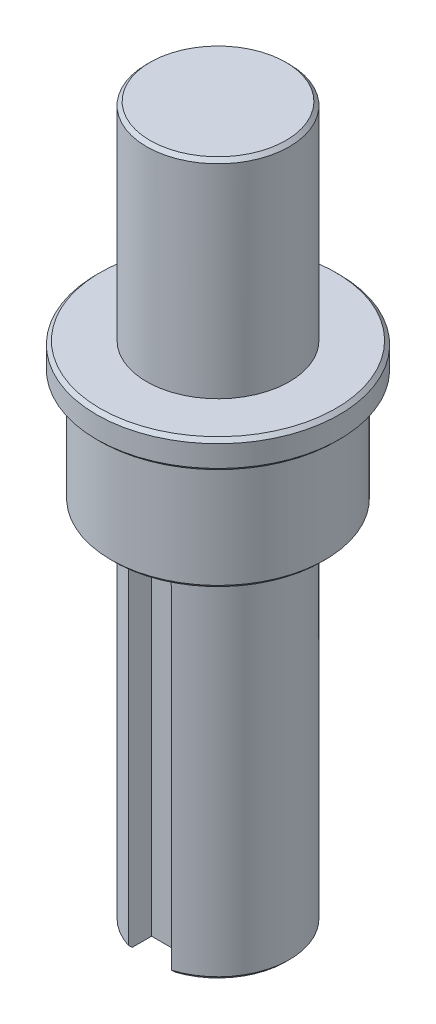
ISO-10303-21;
HEADER;
FILE_DESCRIPTION(('STEP AP214'),'2;1');
FILE_NAME('part.step','',(''),(''),'','','');
FILE_SCHEMA(('AUTOMOTIVE_DESIGN { 1 0 10303 214 1 1 1 1 }'));
ENDSEC;
DATA;
#1=APPLICATION_CONTEXT('core data for automotive mechanical design processes');
#2=APPLICATION_PROTOCOL_DEFINITION('international standard','automotive_design',2000,#1);
#3=PRODUCT_CONTEXT('',#1,'mechanical');
#4=PRODUCT('Part','Part','',(#3));
#5=PRODUCT_RELATED_PRODUCT_CATEGORY('part','',(#4));
#6=PRODUCT_DEFINITION_FORMATION('','',#4);
#7=PRODUCT_DEFINITION_CONTEXT('part definition',#1,'design');
#8=PRODUCT_DEFINITION('design','',#6,#7);
#9=PRODUCT_DEFINITION_SHAPE('','',#8);
#10=(LENGTH_UNIT() NAMED_UNIT(*) SI_UNIT(.MILLI.,.METRE.));
#11=(NAMED_UNIT(*) PLANE_ANGLE_UNIT() SI_UNIT($,.RADIAN.));
#12=(NAMED_UNIT(*) SI_UNIT($,.STERADIAN.) SOLID_ANGLE_UNIT());
#13=UNCERTAINTY_MEASURE_WITH_UNIT(LENGTH_MEASURE(1.E-05),#10,'distance_accuracy_value','');
#14=(GEOMETRIC_REPRESENTATION_CONTEXT(3) GLOBAL_UNCERTAINTY_ASSIGNED_CONTEXT((#13)) GLOBAL_UNIT_ASSIGNED_CONTEXT((#10,
#11,#12)) REPRESENTATION_CONTEXT('',''));
#15=CARTESIAN_POINT('',(0.,0.,0.));
#16=DIRECTION('',(0.,0.,1.));
#17=DIRECTION('',(1.,0.,0.));
#18=AXIS2_PLACEMENT_3D('',#15,#16,#17);
#19=CARTESIAN_POINT('',(0.,55.3655780461796,0.));
#20=DIRECTION('',(0.,1.,0.));
#21=DIRECTION('',(0.,0.,1.));
#22=AXIS2_PLACEMENT_3D('',#19,#20,#21);
#23=PLANE('',#22);
#24=CARTESIAN_POINT('',(0.,55.3655780461796,0.));
#25=DIRECTION('',(0.,1.,0.));
#26=DIRECTION('',(0.,0.,1.));
#27=AXIS2_PLACEMENT_3D('',#24,#25,#26);
#28=CIRCLE('',#27,4.75000000000002);
#29=CARTESIAN_POINT('',(0.,55.3655780461796,4.75000000000002));
#30=VERTEX_POINT('',#29);
#31=EDGE_CURVE('E165',#30,#30,#28,.T.);
#32=ORIENTED_EDGE('',*,*,#31,.T.);
#33=EDGE_LOOP('',(#32));
#34=FACE_BOUND('',#33,.T.);
#35=ADVANCED_FACE('F33',(#34),#23,.T.);
#36=CARTESIAN_POINT('',(0.,0.,0.));
#37=DIRECTION('',(0.,-1.,0.));
#38=DIRECTION('',(0.,0.,-1.));
#39=AXIS2_PLACEMENT_3D('',#36,#37,#38);
#40=CYLINDRICAL_SURFACE('',#39,5.);
#41=CARTESIAN_POINT('',(0.,55.1155780461796,0.));
#42=DIRECTION('',(0.,1.,0.));
#43=DIRECTION('',(0.,0.,1.));
#44=AXIS2_PLACEMENT_3D('',#41,#42,#43);
#45=CIRCLE('',#44,5.);
#46=CARTESIAN_POINT('',(0.,55.1155780461796,5.));
#47=VERTEX_POINT('',#46);
#48=EDGE_CURVE('E162',#47,#47,#45,.F.);
#49=ORIENTED_EDGE('',*,*,#48,.T.);
#50=EDGE_LOOP('',(#49));
#51=FACE_BOUND('',#50,.T.);
#52=CARTESIAN_POINT('',(0.,40.8655780461796,0.));
#53=DIRECTION('',(0.,-1.,0.));
#54=DIRECTION('',(0.,0.,-1.));
#55=AXIS2_PLACEMENT_3D('',#52,#53,#54);
#56=CIRCLE('',#55,5.);
#57=CARTESIAN_POINT('',(0.,40.8655780461796,-5.));
#58=VERTEX_POINT('',#57);
#59=EDGE_CURVE('E130',#58,#58,#56,.T.);
#60=ORIENTED_EDGE('',*,*,#59,.F.);
#61=EDGE_LOOP('',(#60));
#62=FACE_BOUND('',#61,.T.);
#63=ADVANCED_FACE('F239',(#51,#62),#40,.T.);
#64=CARTESIAN_POINT('',(5.,40.8655780461796,0.));
#65=DIRECTION('',(0.,1.,0.));
#66=DIRECTION('',(0.,0.,1.));
#67=AXIS2_PLACEMENT_3D('',#64,#65,#66);
#68=PLANE('',#67);
#69=CARTESIAN_POINT('',(0.,40.8655780461796,0.));
#70=DIRECTION('',(0.,1.,0.));
#71=DIRECTION('',(0.,0.,1.));
#72=AXIS2_PLACEMENT_3D('',#69,#70,#71);
#73=CIRCLE('',#72,8.24999999999998);
#74=CARTESIAN_POINT('',(0.,40.8655780461796,8.24999999999998));
#75=VERTEX_POINT('',#74);
#76=EDGE_CURVE('E148',#75,#75,#73,.T.);
#77=ORIENTED_EDGE('',*,*,#76,.T.);
#78=EDGE_LOOP('',(#77));
#79=FACE_BOUND('',#78,.T.);
#80=ORIENTED_EDGE('',*,*,#59,.T.);
#81=EDGE_LOOP('',(#80));
#82=FACE_BOUND('',#81,.T.);
#83=ADVANCED_FACE('F245',(#79,#82),#68,.T.);
#84=CARTESIAN_POINT('',(0.,0.,0.));
#85=DIRECTION('',(0.,-1.,0.));
#86=DIRECTION('',(0.,0.,-1.));
#87=AXIS2_PLACEMENT_3D('',#84,#85,#86);
#88=CYLINDRICAL_SURFACE('',#87,8.5);
#89=CARTESIAN_POINT('',(0.,39.1155780461796,0.));
#90=DIRECTION('',(0.,-1.,0.));
#91=DIRECTION('',(0.,0.,-1.));
#92=AXIS2_PLACEMENT_3D('',#89,#90,#91);
#93=CIRCLE('',#92,8.5);
#94=CARTESIAN_POINT('',(0.,39.1155780461796,-8.5));
#95=VERTEX_POINT('',#94);
#96=EDGE_CURVE('E145',#95,#95,#93,.F.);
#97=ORIENTED_EDGE('',*,*,#96,.T.);
#98=EDGE_LOOP('',(#97));
#99=FACE_BOUND('',#98,.T.);
#100=CARTESIAN_POINT('',(0.,40.6155780461796,0.));
#101=DIRECTION('',(0.,1.,0.));
#102=DIRECTION('',(0.,0.,1.));
#103=AXIS2_PLACEMENT_3D('',#100,#101,#102);
#104=CIRCLE('',#103,8.5);
#105=CARTESIAN_POINT('',(0.,40.6155780461796,8.5));
#106=VERTEX_POINT('',#105);
#107=EDGE_CURVE('E142',#106,#106,#104,.F.);
#108=ORIENTED_EDGE('',*,*,#107,.T.);
#109=EDGE_LOOP('',(#108));
#110=FACE_BOUND('',#109,.T.);
#111=ADVANCED_FACE('F349',(#99,#110),#88,.T.);
#112=CARTESIAN_POINT('',(8.5,38.8655780461796,0.));
#113=DIRECTION('',(0.,-1.,0.));
#114=DIRECTION('',(0.,0.,-1.));
#115=AXIS2_PLACEMENT_3D('',#112,#113,#114);
#116=PLANE('',#115);
#117=CARTESIAN_POINT('',(0.,38.8655780461796,0.));
#118=DIRECTION('',(0.,-1.,0.));
#119=DIRECTION('',(0.,0.,-1.));
#120=AXIS2_PLACEMENT_3D('',#117,#118,#119);
#121=CIRCLE('',#120,8.25);
#122=CARTESIAN_POINT('',(0.,38.8655780461796,-8.25));
#123=VERTEX_POINT('',#122);
#124=EDGE_CURVE('E139',#123,#123,#121,.T.);
#125=ORIENTED_EDGE('',*,*,#124,.T.);
#126=EDGE_LOOP('',(#125));
#127=FACE_BOUND('',#126,.T.);
#128=CARTESIAN_POINT('',(0.,38.8655780461796,0.));
#129=DIRECTION('',(0.,-1.,0.));
#130=DIRECTION('',(0.,0.,-1.));
#131=AXIS2_PLACEMENT_3D('',#128,#129,#130);
#132=CIRCLE('',#131,7.5);
#133=CARTESIAN_POINT('',(0.,38.8655780461796,-7.5));
#134=VERTEX_POINT('',#133);
#135=EDGE_CURVE('E127',#134,#134,#132,.T.);
#136=ORIENTED_EDGE('',*,*,#135,.F.);
#137=EDGE_LOOP('',(#136));
#138=FACE_BOUND('',#137,.T.);
#139=ADVANCED_FACE('F342',(#127,#138),#116,.T.);
#140=CARTESIAN_POINT('',(0.,0.,0.));
#141=DIRECTION('',(0.,-1.,0.));
#142=DIRECTION('',(0.,0.,-1.));
#143=AXIS2_PLACEMENT_3D('',#140,#141,#142);
#144=CYLINDRICAL_SURFACE('',#143,7.5);
#145=CARTESIAN_POINT('',(0.,31.3155780461796,0.));
#146=DIRECTION('',(0.,-1.,0.));
#147=DIRECTION('',(0.,0.,-1.));
#148=AXIS2_PLACEMENT_3D('',#145,#146,#147);
#149=CIRCLE('',#148,7.5);
#150=CARTESIAN_POINT('',(0.,31.3155780461796,-7.5));
#151=VERTEX_POINT('',#150);
#152=EDGE_CURVE('E136',#151,#151,#149,.F.);
#153=ORIENTED_EDGE('',*,*,#152,.T.);
#154=EDGE_LOOP('',(#153));
#155=FACE_BOUND('',#154,.T.);
#156=ORIENTED_EDGE('',*,*,#135,.T.);
#157=EDGE_LOOP('',(#156));
#158=FACE_BOUND('',#157,.T.);
#159=ADVANCED_FACE('F337',(#155,#158),#144,.T.);
#160=CARTESIAN_POINT('',(7.5,31.0655780461796,0.));
#161=DIRECTION('',(0.,-1.,0.));
#162=DIRECTION('',(0.,0.,-1.));
#163=AXIS2_PLACEMENT_3D('',#160,#161,#162);
#164=PLANE('',#163);
#165=CARTESIAN_POINT('',(0.,31.0655780461796,0.));
#166=DIRECTION('',(0.,-1.,0.));
#167=DIRECTION('',(0.,0.,-1.));
#168=AXIS2_PLACEMENT_3D('',#165,#166,#167);
#169=CIRCLE('',#168,7.25000000000002);
#170=CARTESIAN_POINT('',(0.,31.0655780461796,-7.25000000000002));
#171=VERTEX_POINT('',#170);
#172=EDGE_CURVE('E133',#171,#171,#169,.T.);
#173=ORIENTED_EDGE('',*,*,#172,.T.);
#174=EDGE_LOOP('',(#173));
#175=FACE_BOUND('',#174,.T.);
#176=CARTESIAN_POINT('',(0.,31.0655780461796,0.));
#177=DIRECTION('',(0.,-1.,0.));
#178=DIRECTION('',(0.,0.,-1.));
#179=AXIS2_PLACEMENT_3D('',#176,#177,#178);
#180=CIRCLE('',#179,5.);
#181=CARTESIAN_POINT('',(0.,31.0655780461796,-5.));
#182=VERTEX_POINT('',#181);
#183=EDGE_CURVE('E124',#182,#182,#180,.T.);
#184=ORIENTED_EDGE('',*,*,#183,.F.);
#185=EDGE_LOOP('',(#184));
#186=FACE_BOUND('',#185,.T.);
#187=ADVANCED_FACE('F211',(#175,#186),#164,.T.);
#188=CARTESIAN_POINT('',(0.,0.,0.));
#189=DIRECTION('',(0.,-1.,0.));
#190=DIRECTION('',(0.,0.,-1.));
#191=AXIS2_PLACEMENT_3D('',#188,#189,#190);
#192=CYLINDRICAL_SURFACE('',#191,5.);
#193=DIRECTION('',(0.,-1.,0.));
#194=VECTOR('',#193,1.);
#195=CARTESIAN_POINT('',(-1.5,0.,4.76969600708473));
#196=LINE('',#195,#194);
#197=CARTESIAN_POINT('',(-1.5,29.0655780461796,4.76969600708473));
#198=VERTEX_POINT('',#197);
#199=CARTESIAN_POINT('',(-1.5,5.81557804617957,4.76969600708473));
#200=VERTEX_POINT('',#199);
#201=EDGE_CURVE('E119',#198,#200,#196,.T.);
#202=ORIENTED_EDGE('',*,*,#201,.F.);
#203=CARTESIAN_POINT('',(-1.5,29.0655780461796,4.76969600708473));
#204=CARTESIAN_POINT('',(-1.50000085359987,29.1067588568557,4.76969248993095));
#205=CARTESIAN_POINT('',(-1.49830305374632,29.1479189250242,4.77023000663726));
#206=CARTESIAN_POINT('',(-1.49153727481279,29.2299248430673,4.77235113343356));
#207=CARTESIAN_POINT('',(-1.48647005385463,29.2707707615349,4.7739345082043));
#208=CARTESIAN_POINT('',(-1.46630065235378,29.3921740899327,4.78018533002168));
#209=CARTESIAN_POINT('',(-1.44623028637151,29.4718871065223,4.78635397305579));
#210=CARTESIAN_POINT('',(-1.39353147335906,29.6266123274067,4.80195939037488));
#211=CARTESIAN_POINT('',(-1.36090719903445,29.7016260840324,4.81139507864529));
#212=CARTESIAN_POINT('',(-1.28407985018232,29.8451724452828,4.8324653260204));
#213=CARTESIAN_POINT('',(-1.23987100279312,29.9137017953376,4.8441009806121));
#214=CARTESIAN_POINT('',(-1.13964930893702,30.0444432152147,4.86866818200433));
#215=CARTESIAN_POINT('',(-1.08333633607985,30.1064199966792,4.88162718483485));
#216=CARTESIAN_POINT('',(-0.961140113903204,30.2202123641536,4.90714781796852));
#217=CARTESIAN_POINT('',(-0.89525500200505,30.2720259679565,4.9197093703538));
#218=CARTESIAN_POINT('',(-0.754090160225416,30.3650558233472,4.94333592434221));
#219=CARTESIAN_POINT('',(-0.678642338077991,30.4060269492916,4.95436400128813));
#220=CARTESIAN_POINT('',(-0.521563369050344,30.4745847769378,4.97335005202751));
#221=CARTESIAN_POINT('',(-0.439937649841662,30.5021830732554,4.98131068415016));
#222=CARTESIAN_POINT('',(-0.298264456021696,30.5368470073067,4.99143710038863));
#223=CARTESIAN_POINT('',(-0.239166490668787,30.5475994120532,4.99462764738927));
#224=CARTESIAN_POINT('',(-0.12005739141902,30.5619720635374,4.998918178526));
#225=CARTESIAN_POINT('',(-0.0600465820525057,30.565594787908,5.00001888889585));
#226=CARTESIAN_POINT('',(0.,30.5655780461796,5.));
#227=B_SPLINE_CURVE_WITH_KNOTS('',3,(#203,#204,#205,#206,#207,#208,#209,#210,#211,#212,#213,
#214,#215,#216,#217,#218,#219,#220,#221,#222,#223,#224,#225,#226),.UNSPECIFIED.,.F.,.F.,(4,2,2,
2,2,2,2,2,2,2,2,4),(0.,0.123463321048064,0.24689887216849,0.492911372366583,0.738842172727399,
0.984895759946682,1.23795183323011,1.49105721311967,1.74947248420819,2.00766329935825,
2.1876802778492,2.36763468764484),.UNSPECIFIED.);
#228=CARTESIAN_POINT('',(0.,30.5655780461796,5.));
#229=VERTEX_POINT('',#228);
#230=EDGE_CURVE('E11',#198,#229,#227,.T.);
#231=ORIENTED_EDGE('',*,*,#230,.T.);
#232=CARTESIAN_POINT('',(0.,30.5655780461796,5.));
#233=CARTESIAN_POINT('',(0.0412230773899808,30.5655787870539,5.00000277613313));
#234=CARTESIAN_POINT('',(0.0824255570982469,30.5638776069156,4.99948958398081));
#235=CARTESIAN_POINT('',(0.164518730866948,30.5570976301866,4.99746087704899));
#236=CARTESIAN_POINT('',(0.205409485177794,30.5520195039418,4.9959455611979));
#237=CARTESIAN_POINT('',(0.326963301776202,30.5318028708759,4.98995381331756));
#238=CARTESIAN_POINT('',(0.406785158642714,30.5116816969559,4.98403118606551));
#239=CARTESIAN_POINT('',(0.561734538434264,30.4588351670383,4.96895678681409));
#240=CARTESIAN_POINT('',(0.636863069535107,30.4261125288633,4.95980571114645));
#241=CARTESIAN_POINT('',(0.780600785691843,30.3490549515031,4.93922435519071));
#242=CARTESIAN_POINT('',(0.849207204843492,30.3047151153591,4.92779311423827));
#243=CARTESIAN_POINT('',(0.97986969539363,30.2043564797735,4.90350796272656));
#244=CARTESIAN_POINT('',(1.0417124952522,30.1480671774607,4.8906250718143));
#245=CARTESIAN_POINT('',(1.15524422121796,30.025974419819,4.86505948668359));
#246=CARTESIAN_POINT('',(1.20693049442307,29.9601684865012,4.85237684556416));
#247=CARTESIAN_POINT('',(1.29981663905891,29.8190842149488,4.82833698781928));
#248=CARTESIAN_POINT('',(1.34075062074078,29.7436241491111,4.81701657361784));
#249=CARTESIAN_POINT('',(1.40923482373452,29.5865232188316,4.79742985037451));
#250=CARTESIAN_POINT('',(1.43679764279335,29.5048882562876,4.78916066835566));
#251=CARTESIAN_POINT('',(1.47137173672671,29.36331012738,4.77862845517374));
#252=CARTESIAN_POINT('',(1.48208442594249,29.3043243465226,4.77530350348452));
#253=CARTESIAN_POINT('',(1.49640626854262,29.1854306551123,4.7708262463819));
#254=CARTESIAN_POINT('',(1.5000169977961,29.1255229521007,4.76967345898471));
#255=CARTESIAN_POINT('',(1.5,29.0655780461796,4.76969600708473));
#256=B_SPLINE_CURVE_WITH_KNOTS('',3,(#232,#233,#234,#235,#236,#237,#238,#239,#240,#241,#242,
#243,#244,#245,#246,#247,#248,#249,#250,#251,#252,#253,#254,#255),.UNSPECIFIED.,.F.,.F.,(4,2,2,
2,2,2,2,2,2,2,2,4),(0.,0.123590522760266,0.247156519315276,0.493467728235494,0.73972584367575,
0.98608793095597,1.23877207809718,1.49152213929097,1.75003354782293,2.00830092246139,
2.18798745648376,2.36763411497588),.UNSPECIFIED.);
#257=CARTESIAN_POINT('',(1.5,29.0655780461796,4.76969600708473));
#258=VERTEX_POINT('',#257);
#259=EDGE_CURVE('E43',#229,#258,#256,.T.);
#260=ORIENTED_EDGE('',*,*,#259,.T.);
#261=DIRECTION('',(0.,-1.,0.));
#262=VECTOR('',#261,1.);
#263=CARTESIAN_POINT('',(1.5,0.,4.76969600708473));
#264=LINE('',#263,#262);
#265=CARTESIAN_POINT('',(1.5,5.81557804617957,4.76969600708473));
#266=VERTEX_POINT('',#265);
#267=EDGE_CURVE('E115',#266,#258,#264,.F.);
#268=ORIENTED_EDGE('',*,*,#267,.F.);
#269=CARTESIAN_POINT('',(0.,5.81557804617957,0.));
#270=DIRECTION('',(0.,-1.,0.));
#271=DIRECTION('',(0.,0.,-1.));
#272=AXIS2_PLACEMENT_3D('',#269,#270,#271);
#273=CIRCLE('',#272,5.);
#274=EDGE_CURVE('E159',#266,#200,#273,.F.);
#275=ORIENTED_EDGE('',*,*,#274,.T.);
#276=EDGE_LOOP('',(#202,#231,#260,#268,#275));
#277=FACE_BOUND('',#276,.T.);
#278=ORIENTED_EDGE('',*,*,#183,.T.);
#279=EDGE_LOOP('',(#278));
#280=FACE_BOUND('',#279,.T.);
#281=ADVANCED_FACE('F207',(#277,#280),#192,.T.);
#282=CARTESIAN_POINT('',(5.,5.56557804617958,0.));
#283=DIRECTION('',(0.,-1.,0.));
#284=DIRECTION('',(0.,0.,-1.));
#285=AXIS2_PLACEMENT_3D('',#282,#283,#284);
#286=PLANE('',#285);
#287=DIRECTION('',(0.,0.,-1.));
#288=VECTOR('',#287,1.);
#289=CARTESIAN_POINT('',(-1.5,5.56557804617958,6.15));
#290=LINE('',#289,#288);
#291=CARTESIAN_POINT('',(-1.5,5.56557804617958,4.50693909432999));
#292=VERTEX_POINT('',#291);
#293=CARTESIAN_POINT('',(-1.5,5.56557804617958,3.15));
#294=VERTEX_POINT('',#293);
#295=EDGE_CURVE('E102',#292,#294,#290,.T.);
#296=ORIENTED_EDGE('',*,*,#295,.F.);
#297=CARTESIAN_POINT('',(0.,5.56557804617958,0.));
#298=DIRECTION('',(0.,-1.,0.));
#299=DIRECTION('',(0.,0.,-1.));
#300=AXIS2_PLACEMENT_3D('',#297,#298,#299);
#301=CIRCLE('',#300,4.75);
#302=CARTESIAN_POINT('',(1.5,5.56557804617958,4.50693909432999));
#303=VERTEX_POINT('',#302);
#304=EDGE_CURVE('E154',#292,#303,#301,.T.);
#305=ORIENTED_EDGE('',*,*,#304,.T.);
#306=DIRECTION('',(0.,0.,1.));
#307=VECTOR('',#306,1.);
#308=CARTESIAN_POINT('',(1.5,5.56557804617958,6.15));
#309=LINE('',#308,#307);
#310=CARTESIAN_POINT('',(1.5,5.56557804617958,3.15));
#311=VERTEX_POINT('',#310);
#312=EDGE_CURVE('E99',#311,#303,#309,.T.);
#313=ORIENTED_EDGE('',*,*,#312,.F.);
#314=DIRECTION('',(1.,0.,0.));
#315=VECTOR('',#314,1.);
#316=CARTESIAN_POINT('',(-1.5,5.56557804617958,3.15));
#317=LINE('',#316,#315);
#318=EDGE_CURVE('E94',#294,#311,#317,.T.);
#319=ORIENTED_EDGE('',*,*,#318,.F.);
#320=EDGE_LOOP('',(#296,#305,#313,#319));
#321=FACE_BOUND('',#320,.T.);
#322=CARTESIAN_POINT('',(0.,5.56557804617958,0.));
#323=DIRECTION('',(0.,-1.,0.));
#324=DIRECTION('',(0.,0.,-1.));
#325=AXIS2_PLACEMENT_3D('',#322,#323,#324);
#326=CIRCLE('',#325,1.9);
#327=CARTESIAN_POINT('',(0.,5.56557804617958,-1.9));
#328=VERTEX_POINT('',#327);
#329=EDGE_CURVE('E156',#328,#328,#326,.F.);
#330=ORIENTED_EDGE('',*,*,#329,.T.);
#331=EDGE_LOOP('',(#330));
#332=FACE_BOUND('',#331,.T.);
#333=ADVANCED_FACE('F110',(#321,#332),#286,.T.);
#334=CARTESIAN_POINT('',(0.,15.5655780461796,0.));
#335=DIRECTION('',(0.,-1.,0.));
#336=DIRECTION('',(0.,0.,-1.));
#337=AXIS2_PLACEMENT_3D('',#334,#335,#336);
#338=CONICAL_SURFACE('',#337,1.65,1.02974425867665);
#339=CARTESIAN_POINT('',(0.,16.5569980675751,0.));
#340=VERTEX_POINT('',#339);
#341=VERTEX_LOOP('',#340);
#342=FACE_BOUND('',#341,.T.);
#343=CARTESIAN_POINT('',(0.,15.5655780461796,0.));
#344=DIRECTION('',(0.,-1.,0.));
#345=DIRECTION('',(0.,0.,-1.));
#346=AXIS2_PLACEMENT_3D('',#343,#344,#345);
#347=CIRCLE('',#346,1.65);
#348=CARTESIAN_POINT('',(0.,15.5655780461796,-1.65));
#349=VERTEX_POINT('',#348);
#350=EDGE_CURVE('E121',#349,#349,#347,.T.);
#351=ORIENTED_EDGE('',*,*,#350,.T.);
#352=EDGE_LOOP('',(#351));
#353=FACE_BOUND('',#352,.T.);
#354=ADVANCED_FACE('F200',(#342,#353),#338,.F.);
#355=CARTESIAN_POINT('',(0.,5.56557804617958,0.));
#356=DIRECTION('',(0.,-1.,0.));
#357=DIRECTION('',(0.,0.,-1.));
#358=AXIS2_PLACEMENT_3D('',#355,#356,#357);
#359=CYLINDRICAL_SURFACE('',#358,1.65);
#360=CARTESIAN_POINT('',(0.,5.81557804617958,0.));
#361=DIRECTION('',(0.,-1.,0.));
#362=DIRECTION('',(0.,0.,-1.));
#363=AXIS2_PLACEMENT_3D('',#360,#361,#362);
#364=CIRCLE('',#363,1.65);
#365=CARTESIAN_POINT('',(0.,5.81557804617958,-1.65));
#366=VERTEX_POINT('',#365);
#367=EDGE_CURVE('E151',#366,#366,#364,.T.);
#368=ORIENTED_EDGE('',*,*,#367,.T.);
#369=EDGE_LOOP('',(#368));
#370=FACE_BOUND('',#369,.T.);
#371=ORIENTED_EDGE('',*,*,#350,.F.);
#372=EDGE_LOOP('',(#371));
#373=FACE_BOUND('',#372,.T.);
#374=ADVANCED_FACE('F196',(#370,#373),#359,.F.);
#375=CARTESIAN_POINT('',(0.,31.0655780461796,0.));
#376=DIRECTION('',(0.,1.,0.));
#377=DIRECTION('',(0.,0.,1.));
#378=AXIS2_PLACEMENT_3D('',#375,#376,#377);
#379=CONICAL_SURFACE('',#378,7.25000000000002,0.785398163397443);
#380=ORIENTED_EDGE('',*,*,#152,.F.);
#381=EDGE_LOOP('',(#380));
#382=FACE_BOUND('',#381,.T.);
#383=ORIENTED_EDGE('',*,*,#172,.F.);
#384=EDGE_LOOP('',(#383));
#385=FACE_BOUND('',#384,.T.);
#386=ADVANCED_FACE('F199',(#382,#385),#379,.T.);
#387=CARTESIAN_POINT('',(0.,38.8655780461796,0.));
#388=DIRECTION('',(0.,1.,0.));
#389=DIRECTION('',(0.,0.,1.));
#390=AXIS2_PLACEMENT_3D('',#387,#388,#389);
#391=CONICAL_SURFACE('',#390,8.25,0.785398163397448);
#392=ORIENTED_EDGE('',*,*,#96,.F.);
#393=EDGE_LOOP('',(#392));
#394=FACE_BOUND('',#393,.T.);
#395=ORIENTED_EDGE('',*,*,#124,.F.);
#396=EDGE_LOOP('',(#395));
#397=FACE_BOUND('',#396,.T.);
#398=ADVANCED_FACE('F252',(#394,#397),#391,.T.);
#399=CARTESIAN_POINT('',(0.,40.6155780461796,0.));
#400=DIRECTION('',(0.,-1.,0.));
#401=DIRECTION('',(0.,0.,-1.));
#402=AXIS2_PLACEMENT_3D('',#399,#400,#401);
#403=CONICAL_SURFACE('',#402,8.5,0.785398163397455);
#404=ORIENTED_EDGE('',*,*,#76,.F.);
#405=EDGE_LOOP('',(#404));
#406=FACE_BOUND('',#405,.T.);
#407=ORIENTED_EDGE('',*,*,#107,.F.);
#408=EDGE_LOOP('',(#407));
#409=FACE_BOUND('',#408,.T.);
#410=ADVANCED_FACE('F256',(#406,#409),#403,.T.);
#411=CARTESIAN_POINT('',(0.,5.81557804617958,0.));
#412=DIRECTION('',(0.,-1.,0.));
#413=DIRECTION('',(0.,0.,-1.));
#414=AXIS2_PLACEMENT_3D('',#411,#412,#413);
#415=CONICAL_SURFACE('',#414,1.65,0.785398163397437);
#416=ORIENTED_EDGE('',*,*,#329,.F.);
#417=EDGE_LOOP('',(#416));
#418=FACE_BOUND('',#417,.T.);
#419=ORIENTED_EDGE('',*,*,#367,.F.);
#420=EDGE_LOOP('',(#419));
#421=FACE_BOUND('',#420,.T.);
#422=ADVANCED_FACE('F234',(#418,#421),#415,.F.);
#423=CARTESIAN_POINT('',(0.,5.56557804617958,0.));
#424=DIRECTION('',(0.,1.,0.));
#425=DIRECTION('',(0.,0.,1.));
#426=AXIS2_PLACEMENT_3D('',#423,#424,#425);
#427=CONICAL_SURFACE('',#426,4.75,0.785398163397455);
#428=CARTESIAN_POINT('',(-1.5,7.89533460774791,6.91902832564446));
#429=CARTESIAN_POINT('',(-1.5,7.69647598334168,6.71553036797981));
#430=CARTESIAN_POINT('',(-1.5,7.49779954301674,6.51185357771266));
#431=CARTESIAN_POINT('',(-1.5,7.10098930384228,6.10398960654604));
#432=CARTESIAN_POINT('',(-1.5,6.90285548158691,5.89980244841184));
#433=CARTESIAN_POINT('',(-1.5,6.5073678458266,5.49082637246406));
#434=CARTESIAN_POINT('',(-1.5,6.31001376007984,5.28603771817635));
#435=CARTESIAN_POINT('',(-1.5,5.91628042457067,4.87550503869363));
#436=CARTESIAN_POINT('',(-1.5,5.7199012243852,4.66976096592086));
#437=CARTESIAN_POINT('',(-1.5,5.32845111293506,4.25680529238506));
#438=CARTESIAN_POINT('',(-1.5,5.13338101159559,4.04959292165795));
#439=CARTESIAN_POINT('',(-1.5,4.8424390790512,3.73724813314499));
#440=CARTESIAN_POINT('',(-1.5,4.74574148899583,3.6328852475839));
#441=CARTESIAN_POINT('',(-1.5,4.55305150555913,3.42350587425253));
#442=CARTESIAN_POINT('',(-1.5,4.4570591264121,3.31848937336798));
#443=CARTESIAN_POINT('',(-1.5,4.26594122041828,3.10757123419417));
#444=CARTESIAN_POINT('',(-1.5,4.17081616218705,3.00166917054749));
#445=CARTESIAN_POINT('',(-1.5,3.98179320751965,2.78878442607102));
#446=CARTESIAN_POINT('',(-1.5,3.88789524217197,2.68180180652687));
#447=CARTESIAN_POINT('',(-1.5,3.7017325294011,2.46634201067023));
#448=CARTESIAN_POINT('',(-1.5,3.60946845916267,2.35786424633837));
#449=CARTESIAN_POINT('',(-1.5,3.47285965508976,2.19364182998888));
#450=CARTESIAN_POINT('',(-1.5,3.42761703293877,2.13864473575473));
#451=CARTESIAN_POINT('',(-1.5,3.33786793225311,2.02804855440028));
#452=CARTESIAN_POINT('',(-1.5,3.29336149481503,1.97244943395737));
#453=CARTESIAN_POINT('',(-1.5,3.24929430164179,1.91650066843216));
#454=B_SPLINE_CURVE_WITH_KNOTS('',3,(#428,#429,#430,#431,#432,#433,#434,#435,#436,#437,#438,
#439,#440,#441,#442,#443,#444,#445,#446,#447,#448,#449,#450,#451,#452,#453),.UNSPECIFIED.,.F.,
.F.,(4,2,2,2,2,2,2,2,2,2,2,2,4),(0.,0.853584670418638,1.70713192247078,2.56034877988345,
3.41360859129956,4.26735498184592,4.69417608101149,5.12100577178529,5.54805383278679,
5.9750778075097,6.40227480935119,6.61591414221781,6.82956536125783),.UNSPECIFIED.);
#455=EDGE_CURVE('E105',#200,#292,#454,.T.);
#456=ORIENTED_EDGE('',*,*,#455,.F.);
#457=ORIENTED_EDGE('',*,*,#274,.F.);
#458=CARTESIAN_POINT('',(1.5,3.24929430164179,1.91650066843216));
#459=CARTESIAN_POINT('',(1.5,3.32302412288285,2.01004380284105));
#460=CARTESIAN_POINT('',(1.5,3.39792495714748,2.10264501170143));
#461=CARTESIAN_POINT('',(1.5,3.54953814779825,2.286332118577));
#462=CARTESIAN_POINT('',(1.5,3.62625023437719,2.37741823887959));
#463=CARTESIAN_POINT('',(1.5,3.78095218870356,2.55844148706309));
#464=CARTESIAN_POINT('',(1.5,3.85894162911681,2.64837898198863));
#465=CARTESIAN_POINT('',(1.5,4.01592507115388,2.82737869688168));
#466=CARTESIAN_POINT('',(1.5,4.09491911544865,2.91644087938317));
#467=CARTESIAN_POINT('',(1.5,4.33296946533679,3.1825083203277));
#468=CARTESIAN_POINT('',(1.5,4.49317305647103,3.3584859783545));
#469=CARTESIAN_POINT('',(1.5,4.81552443674137,3.7086663476505));
#470=CARTESIAN_POINT('',(1.5,4.9776723630063,3.88286893210659));
#471=CARTESIAN_POINT('',(1.5,5.20425174871498,4.12444003880721));
#472=CARTESIAN_POINT('',(1.5,5.26812352187248,4.19233446960438));
#473=CARTESIAN_POINT('',(1.5,5.39604850698609,4.3279575977517));
#474=CARTESIAN_POINT('',(1.5,5.46010172645213,4.39568628801917));
#475=CARTESIAN_POINT('',(1.5,5.71995134681018,4.66982075394263));
#476=CARTESIAN_POINT('',(1.5,5.91638805027015,4.87561965678679));
#477=CARTESIAN_POINT('',(1.5,6.31024431246382,5.28627570759393));
#478=CARTESIAN_POINT('',(1.5,6.50766387767489,5.49113284933324));
#479=CARTESIAN_POINT('',(1.5,6.90316343000021,5.90012054678869));
#480=CARTESIAN_POINT('',(1.5,7.10124326135089,6.10425125321795));
#481=CARTESIAN_POINT('',(1.5,7.49793306612436,6.51199021657896));
#482=CARTESIAN_POINT('',(1.5,7.69654303038245,6.71559848242461));
#483=CARTESIAN_POINT('',(1.5,7.89533460774791,6.91902832564446));
#484=B_SPLINE_CURVE_WITH_KNOTS('',3,(#458,#459,#460,#461,#462,#463,#464,#465,#466,#467,#468,
#469,#470,#471,#472,#473,#474,#475,#476,#477,#478,#479,#480,#481,#482,#483),.UNSPECIFIED.,.F.,
.F.,(4,2,2,2,2,2,2,2,2,2,2,2,4),(0.,0.357289307053713,0.714525723346356,1.07164497444426,
1.42877944532866,2.14268564208744,2.8566424884237,3.13629080885794,3.41595087798695,
4.26944687365721,5.12294850160169,5.97626131375108,6.82955946852391),.UNSPECIFIED.);
#485=EDGE_CURVE('E168',#303,#266,#484,.T.);
#486=ORIENTED_EDGE('',*,*,#485,.F.);
#487=ORIENTED_EDGE('',*,*,#304,.F.);
#488=EDGE_LOOP('',(#456,#457,#486,#487));
#489=FACE_BOUND('',#488,.T.);
#490=ADVANCED_FACE('F182',(#489),#427,.T.);
#491=CARTESIAN_POINT('',(0.,55.1155780461796,0.));
#492=DIRECTION('',(0.,-1.,0.));
#493=DIRECTION('',(0.,0.,-1.));
#494=AXIS2_PLACEMENT_3D('',#491,#492,#493);
#495=CONICAL_SURFACE('',#494,5.,0.785398163397428);
#496=ORIENTED_EDGE('',*,*,#31,.F.);
#497=EDGE_LOOP('',(#496));
#498=FACE_BOUND('',#497,.T.);
#499=ORIENTED_EDGE('',*,*,#48,.F.);
#500=EDGE_LOOP('',(#499));
#501=FACE_BOUND('',#500,.T.);
#502=ADVANCED_FACE('F195',(#498,#501),#495,.T.);
#503=CARTESIAN_POINT('',(-1.5,30.5655780461796,6.15));
#504=DIRECTION('',(-1.,0.,0.));
#505=DIRECTION('',(0.,0.,1.));
#506=AXIS2_PLACEMENT_3D('',#503,#504,#505);
#507=PLANE('',#506);
#508=DIRECTION('',(0.,-1.,0.));
#509=VECTOR('',#508,1.);
#510=CARTESIAN_POINT('',(-1.5,30.5655780461796,3.15));
#511=LINE('',#510,#509);
#512=CARTESIAN_POINT('',(-1.5,29.0655780461796,3.15));
#513=VERTEX_POINT('',#512);
#514=EDGE_CURVE('E89',#513,#294,#511,.T.);
#515=ORIENTED_EDGE('',*,*,#514,.F.);
#516=DIRECTION('',(0.,0.,-1.));
#517=VECTOR('',#516,1.);
#518=CARTESIAN_POINT('',(-1.5,29.0655780461796,6.15));
#519=LINE('',#518,#517);
#520=EDGE_CURVE('E56',#513,#198,#519,.F.);
#521=ORIENTED_EDGE('',*,*,#520,.T.);
#522=ORIENTED_EDGE('',*,*,#201,.T.);
#523=ORIENTED_EDGE('',*,*,#455,.T.);
#524=ORIENTED_EDGE('',*,*,#295,.T.);
#525=EDGE_LOOP('',(#515,#521,#522,#523,#524));
#526=FACE_BOUND('',#525,.T.);
#527=ADVANCED_FACE('F103',(#526),#507,.F.);
#528=CARTESIAN_POINT('',(1.5,30.5655780461796,6.15));
#529=DIRECTION('',(1.,0.,0.));
#530=DIRECTION('',(0.,0.,-1.));
#531=AXIS2_PLACEMENT_3D('',#528,#529,#530);
#532=PLANE('',#531);
#533=ORIENTED_EDGE('',*,*,#267,.T.);
#534=DIRECTION('',(0.,0.,1.));
#535=VECTOR('',#534,1.);
#536=CARTESIAN_POINT('',(1.5,29.0655780461796,6.15));
#537=LINE('',#536,#535);
#538=CARTESIAN_POINT('',(1.5,29.0655780461796,3.15));
#539=VERTEX_POINT('',#538);
#540=EDGE_CURVE('E326',#258,#539,#537,.F.);
#541=ORIENTED_EDGE('',*,*,#540,.T.);
#542=DIRECTION('',(0.,-1.,0.));
#543=VECTOR('',#542,1.);
#544=CARTESIAN_POINT('',(1.5,30.5655780461796,3.15));
#545=LINE('',#544,#543);
#546=EDGE_CURVE('E98',#539,#311,#545,.T.);
#547=ORIENTED_EDGE('',*,*,#546,.T.);
#548=ORIENTED_EDGE('',*,*,#312,.T.);
#549=ORIENTED_EDGE('',*,*,#485,.T.);
#550=EDGE_LOOP('',(#533,#541,#547,#548,#549));
#551=FACE_BOUND('',#550,.T.);
#552=ADVANCED_FACE('F186',(#551),#532,.F.);
#553=CARTESIAN_POINT('',(-1.5,30.5655780461796,3.15));
#554=DIRECTION('',(0.,0.,-1.));
#555=DIRECTION('',(-1.,0.,0.));
#556=AXIS2_PLACEMENT_3D('',#553,#554,#555);
#557=PLANE('',#556);
#558=ORIENTED_EDGE('',*,*,#546,.F.);
#559=CARTESIAN_POINT('',(0.,29.0655780461796,3.15));
#560=DIRECTION('',(0.,0.,-1.));
#561=DIRECTION('',(-1.,0.,0.));
#562=AXIS2_PLACEMENT_3D('',#559,#560,#561);
#563=CIRCLE('',#562,1.5);
#564=CARTESIAN_POINT('',(0.,30.5655780461796,3.15));
#565=VERTEX_POINT('',#564);
#566=EDGE_CURVE('E325',#539,#565,#563,.F.);
#567=ORIENTED_EDGE('',*,*,#566,.T.);
#568=CARTESIAN_POINT('',(0.,29.0655780461796,3.15));
#569=DIRECTION('',(0.,0.,-1.));
#570=DIRECTION('',(-1.,0.,0.));
#571=AXIS2_PLACEMENT_3D('',#568,#569,#570);
#572=CIRCLE('',#571,1.5);
#573=EDGE_CURVE('E97',#565,#513,#572,.F.);
#574=ORIENTED_EDGE('',*,*,#573,.T.);
#575=ORIENTED_EDGE('',*,*,#514,.T.);
#576=ORIENTED_EDGE('',*,*,#318,.T.);
#577=EDGE_LOOP('',(#558,#567,#574,#575,#576));
#578=FACE_BOUND('',#577,.T.);
#579=ADVANCED_FACE('F92',(#578),#557,.F.);
#580=CARTESIAN_POINT('',(0.,29.0655780461796,0.));
#581=DIRECTION('',(0.,0.,-1.));
#582=DIRECTION('',(-1.,0.,0.));
#583=AXIS2_PLACEMENT_3D('',#580,#581,#582);
#584=CYLINDRICAL_SURFACE('',#583,1.5);
#585=ORIENTED_EDGE('',*,*,#520,.F.);
#586=ORIENTED_EDGE('',*,*,#573,.F.);
#587=DIRECTION('',(0.,0.,-1.));
#588=VECTOR('',#587,1.);
#589=CARTESIAN_POINT('',(0.,30.5655780461796,0.));
#590=LINE('',#589,#588);
#591=EDGE_CURVE('E38',#229,#565,#590,.T.);
#592=ORIENTED_EDGE('',*,*,#591,.F.);
#593=ORIENTED_EDGE('',*,*,#230,.F.);
#594=EDGE_LOOP('',(#585,#586,#592,#593));
#595=FACE_BOUND('',#594,.T.);
#596=ADVANCED_FACE('F35',(#595),#584,.F.);
#597=CARTESIAN_POINT('',(0.,29.0655780461796,0.));
#598=DIRECTION('',(0.,0.,1.));
#599=DIRECTION('',(1.,0.,0.));
#600=AXIS2_PLACEMENT_3D('',#597,#598,#599);
#601=CYLINDRICAL_SURFACE('',#600,1.5);
#602=ORIENTED_EDGE('',*,*,#566,.F.);
#603=ORIENTED_EDGE('',*,*,#540,.F.);
#604=ORIENTED_EDGE('',*,*,#259,.F.);
#605=ORIENTED_EDGE('',*,*,#591,.T.);
#606=EDGE_LOOP('',(#602,#603,#604,#605));
#607=FACE_BOUND('',#606,.T.);
#608=ADVANCED_FACE('F225',(#607),#601,.F.);
#609=CLOSED_SHELL('',(#35,#63,#83,#111,#139,#159,#187,#281,#333,#354,#374,#386,#398,#410,#422,
#490,#502,#527,#552,#579,#596,#608));
#610=MANIFOLD_SOLID_BREP('B2',#609);
#611=ADVANCED_BREP_SHAPE_REPRESENTATION('',(#18,#610),#14);
#612=SHAPE_DEFINITION_REPRESENTATION(#9,#611);
ENDSEC;
END-ISO-10303-21;
